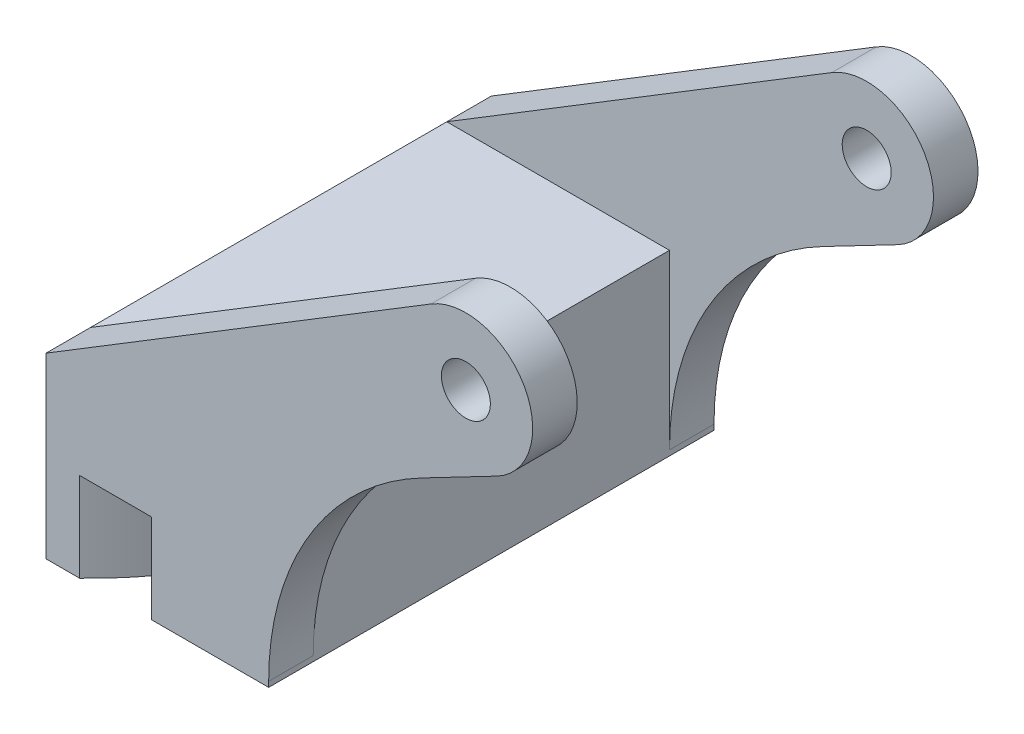
ISO-10303-21;
HEADER;
FILE_DESCRIPTION(('STEP AP214'),'2;1');
FILE_NAME('part.step','',(''),(''),'','','');
FILE_SCHEMA(('AUTOMOTIVE_DESIGN { 1 0 10303 214 1 1 1 1 }'));
ENDSEC;
DATA;
#1=APPLICATION_CONTEXT('core data for automotive mechanical design processes');
#2=APPLICATION_PROTOCOL_DEFINITION('international standard','automotive_design',2000,#1);
#3=PRODUCT_CONTEXT('',#1,'mechanical');
#4=PRODUCT('Part','Part','',(#3));
#5=PRODUCT_RELATED_PRODUCT_CATEGORY('part','',(#4));
#6=PRODUCT_DEFINITION_FORMATION('','',#4);
#7=PRODUCT_DEFINITION_CONTEXT('part definition',#1,'design');
#8=PRODUCT_DEFINITION('design','',#6,#7);
#9=PRODUCT_DEFINITION_SHAPE('','',#8);
#10=(LENGTH_UNIT() NAMED_UNIT(*) SI_UNIT(.MILLI.,.METRE.));
#11=(NAMED_UNIT(*) PLANE_ANGLE_UNIT() SI_UNIT($,.RADIAN.));
#12=(NAMED_UNIT(*) SI_UNIT($,.STERADIAN.) SOLID_ANGLE_UNIT());
#13=UNCERTAINTY_MEASURE_WITH_UNIT(LENGTH_MEASURE(1.E-05),#10,'distance_accuracy_value','');
#14=(GEOMETRIC_REPRESENTATION_CONTEXT(3) GLOBAL_UNCERTAINTY_ASSIGNED_CONTEXT((#13)) GLOBAL_UNIT_ASSIGNED_CONTEXT((#10,
#11,#12)) REPRESENTATION_CONTEXT('',''));
#15=CARTESIAN_POINT('',(0.,0.,0.));
#16=DIRECTION('',(0.,0.,1.));
#17=DIRECTION('',(1.,0.,0.));
#18=AXIS2_PLACEMENT_3D('',#15,#16,#17);
#19=CARTESIAN_POINT('',(-59.8690905122496,-38.0999999999997,63.5));
#20=DIRECTION('',(0.,1.,0.));
#21=DIRECTION('',(-1.,0.,0.));
#22=AXIS2_PLACEMENT_3D('',#19,#20,#21);
#23=PLANE('',#22);
#24=CARTESIAN_POINT('',(-85.2690905122496,-38.0999999999997,31.75));
#25=DIRECTION('',(0.,-1.,0.));
#26=DIRECTION('',(1.,0.,0.));
#27=AXIS2_PLACEMENT_3D('',#24,#25,#26);
#28=CIRCLE('',#27,43.815);
#29=CARTESIAN_POINT('',(-55.074857205209,-38.0999999999997,0.));
#30=VERTEX_POINT('',#29);
#31=CARTESIAN_POINT('',(-55.074857205209,-38.0999999999997,63.5));
#32=VERTEX_POINT('',#31);
#33=EDGE_CURVE('E172',#30,#32,#28,.T.);
#34=ORIENTED_EDGE('',*,*,#33,.F.);
#35=DIRECTION('',(1.,0.,0.));
#36=VECTOR('',#35,1.);
#37=CARTESIAN_POINT('',(-59.8690905122496,-38.0999999999997,0.));
#38=LINE('',#37,#36);
#39=CARTESIAN_POINT('',(-44.8030958377084,-38.0999999999997,0.));
#40=VERTEX_POINT('',#39);
#41=EDGE_CURVE('E208',#30,#40,#38,.T.);
#42=ORIENTED_EDGE('',*,*,#41,.T.);
#43=CARTESIAN_POINT('',(-85.2690905122496,-38.0999999999997,31.75));
#44=DIRECTION('',(0.,1.,0.));
#45=DIRECTION('',(1.,0.,0.));
#46=AXIS2_PLACEMENT_3D('',#43,#44,#45);
#47=CIRCLE('',#46,51.435);
#48=CARTESIAN_POINT('',(-44.8030958377084,-38.0999999999997,63.5));
#49=VERTEX_POINT('',#48);
#50=EDGE_CURVE('E175',#49,#40,#47,.T.);
#51=ORIENTED_EDGE('',*,*,#50,.F.);
#52=DIRECTION('',(1.,0.,0.));
#53=VECTOR('',#52,1.);
#54=CARTESIAN_POINT('',(-59.8690905122496,-38.0999999999997,63.5));
#55=LINE('',#54,#53);
#56=EDGE_CURVE('E213',#32,#49,#55,.T.);
#57=ORIENTED_EDGE('',*,*,#56,.F.);
#58=EDGE_LOOP('',(#34,#42,#51,#57));
#59=FACE_BOUND('',#58,.T.);
#60=ADVANCED_FACE('F33',(#59),#23,.F.);
#61=CARTESIAN_POINT('',(4.40302140132008,-8.44624339807451,63.5));
#62=DIRECTION('',(-0.462259464705518,0.886744713708612,0.));
#63=DIRECTION('',(-0.886744713708612,-0.462259464705518,0.));
#64=AXIS2_PLACEMENT_3D('',#61,#62,#63);
#65=PLANE('',#64);
#66=DIRECTION('',(0.886744713708612,0.462259464705518,0.));
#67=VECTOR('',#66,1.);
#68=CARTESIAN_POINT('',(4.40302140132008,-8.44624339807451,63.5));
#69=LINE('',#68,#67);
#70=CARTESIAN_POINT('',(-6.26531515788185,-14.0076405746417,63.5));
#71=VERTEX_POINT('',#70);
#72=CARTESIAN_POINT('',(4.40302140132009,-8.44624339807451,63.5));
#73=VERTEX_POINT('',#72);
#74=EDGE_CURVE('E291',#71,#73,#69,.T.);
#75=ORIENTED_EDGE('',*,*,#74,.F.);
#76=DIRECTION('',(0.,0.,-1.));
#77=VECTOR('',#76,1.);
#78=CARTESIAN_POINT('',(-6.26531515788185,-14.0076405746417,57.15));
#79=LINE('',#78,#77);
#80=CARTESIAN_POINT('',(-6.26531515788185,-14.0076405746417,57.15));
#81=VERTEX_POINT('',#80);
#82=EDGE_CURVE('E341',#71,#81,#79,.T.);
#83=ORIENTED_EDGE('',*,*,#82,.T.);
#84=DIRECTION('',(0.886744713708612,0.462259464705518,0.));
#85=VECTOR('',#84,1.);
#86=CARTESIAN_POINT('',(4.40302140132008,-8.44624339807451,57.15));
#87=LINE('',#86,#85);
#88=CARTESIAN_POINT('',(4.40302140132009,-8.44624339807451,57.15));
#89=VERTEX_POINT('',#88);
#90=EDGE_CURVE('E277',#81,#89,#87,.T.);
#91=ORIENTED_EDGE('',*,*,#90,.T.);
#92=DIRECTION('',(0.,0.,-1.));
#93=VECTOR('',#92,1.);
#94=CARTESIAN_POINT('',(4.40302140132009,-8.44624339807451,63.5));
#95=LINE('',#94,#93);
#96=EDGE_CURVE('E239',#73,#89,#95,.T.);
#97=ORIENTED_EDGE('',*,*,#96,.F.);
#98=EDGE_LOOP('',(#75,#83,#91,#97));
#99=FACE_BOUND('',#98,.T.);
#100=ADVANCED_FACE('F352',(#99),#65,.F.);
#101=CARTESIAN_POINT('',(0.,0.,63.5));
#102=DIRECTION('',(0.,0.,-1.));
#103=DIRECTION('',(-1.,0.,0.));
#104=AXIS2_PLACEMENT_3D('',#101,#102,#103);
#105=CYLINDRICAL_SURFACE('',#104,9.525);
#106=CARTESIAN_POINT('',(0.,0.,57.15));
#107=DIRECTION('',(0.,0.,1.));
#108=DIRECTION('',(1.,0.,0.));
#109=AXIS2_PLACEMENT_3D('',#106,#107,#108);
#110=CIRCLE('',#109,9.525);
#111=CARTESIAN_POINT('',(-4.96423642167006,8.12908246666033,57.15));
#112=VERTEX_POINT('',#111);
#113=EDGE_CURVE('E275',#89,#112,#110,.T.);
#114=ORIENTED_EDGE('',*,*,#113,.T.);
#115=DIRECTION('',(0.,0.,-1.));
#116=VECTOR('',#115,1.);
#117=CARTESIAN_POINT('',(-4.96423642167005,8.12908246666034,63.5));
#118=LINE('',#117,#116);
#119=CARTESIAN_POINT('',(-4.96423642167005,8.12908246666034,63.5));
#120=VERTEX_POINT('',#119);
#121=EDGE_CURVE('E235',#120,#112,#118,.T.);
#122=ORIENTED_EDGE('',*,*,#121,.F.);
#123=CARTESIAN_POINT('',(0.,0.,63.5));
#124=DIRECTION('',(0.,0.,1.));
#125=DIRECTION('',(1.,0.,0.));
#126=AXIS2_PLACEMENT_3D('',#123,#124,#125);
#127=CIRCLE('',#126,9.525);
#128=EDGE_CURVE('E293',#73,#120,#127,.T.);
#129=ORIENTED_EDGE('',*,*,#128,.F.);
#130=ORIENTED_EDGE('',*,*,#96,.T.);
#131=EDGE_LOOP('',(#114,#122,#129,#130));
#132=FACE_BOUND('',#131,.T.);
#133=ADVANCED_FACE('F356',(#132),#105,.T.);
#134=CARTESIAN_POINT('',(-59.8690905122496,-25.3999999999997,63.5));
#135=DIRECTION('',(0.521179676815753,-0.85344697812707,0.));
#136=DIRECTION('',(0.85344697812707,0.521179676815753,0.));
#137=AXIS2_PLACEMENT_3D('',#134,#135,#136);
#138=PLANE('',#137);
#139=ORIENTED_EDGE('',*,*,#121,.T.);
#140=DIRECTION('',(-0.85344697812707,-0.521179676815753,0.));
#141=VECTOR('',#140,1.);
#142=CARTESIAN_POINT('',(-59.8690905122496,-25.3999999999997,57.15));
#143=LINE('',#142,#141);
#144=CARTESIAN_POINT('',(-59.8690905122496,-25.3999999999997,57.15));
#145=VERTEX_POINT('',#144);
#146=EDGE_CURVE('E250',#112,#145,#143,.T.);
#147=ORIENTED_EDGE('',*,*,#146,.T.);
#148=DIRECTION('',(0.,0.,-1.));
#149=VECTOR('',#148,1.);
#150=CARTESIAN_POINT('',(-59.8690905122496,-25.3999999999997,63.5));
#151=LINE('',#150,#149);
#152=CARTESIAN_POINT('',(-59.8690905122496,-25.3999999999997,63.5));
#153=VERTEX_POINT('',#152);
#154=EDGE_CURVE('E230',#153,#145,#151,.T.);
#155=ORIENTED_EDGE('',*,*,#154,.F.);
#156=DIRECTION('',(-0.85344697812707,-0.521179676815753,0.));
#157=VECTOR('',#156,1.);
#158=CARTESIAN_POINT('',(-59.8690905122496,-25.3999999999997,63.5));
#159=LINE('',#158,#157);
#160=EDGE_CURVE('E294',#120,#153,#159,.T.);
#161=ORIENTED_EDGE('',*,*,#160,.F.);
#162=EDGE_LOOP('',(#139,#147,#155,#161));
#163=FACE_BOUND('',#162,.T.);
#164=ADVANCED_FACE('F310',(#163),#138,.F.);
#165=CARTESIAN_POINT('',(0.,0.,63.5));
#166=DIRECTION('',(0.,0.,-1.));
#167=DIRECTION('',(-1.,0.,0.));
#168=AXIS2_PLACEMENT_3D('',#165,#166,#167);
#169=CYLINDRICAL_SURFACE('',#168,3.4925);
#170=CARTESIAN_POINT('',(0.,0.,57.15));
#171=DIRECTION('',(0.,0.,1.));
#172=DIRECTION('',(1.,0.,0.));
#173=AXIS2_PLACEMENT_3D('',#170,#171,#172);
#174=CIRCLE('',#173,3.4925);
#175=CARTESIAN_POINT('',(3.4925,0.,57.15));
#176=VERTEX_POINT('',#175);
#177=EDGE_CURVE('E248',#176,#176,#174,.T.);
#178=ORIENTED_EDGE('',*,*,#177,.F.);
#179=EDGE_LOOP('',(#178));
#180=FACE_BOUND('',#179,.T.);
#181=CARTESIAN_POINT('',(0.,0.,63.5));
#182=DIRECTION('',(0.,0.,1.));
#183=DIRECTION('',(1.,0.,0.));
#184=AXIS2_PLACEMENT_3D('',#181,#182,#183);
#185=CIRCLE('',#184,3.4925);
#186=CARTESIAN_POINT('',(3.4925,0.,63.5));
#187=VERTEX_POINT('',#186);
#188=EDGE_CURVE('E282',#187,#187,#185,.T.);
#189=ORIENTED_EDGE('',*,*,#188,.T.);
#190=EDGE_LOOP('',(#189));
#191=FACE_BOUND('',#190,.T.);
#192=ADVANCED_FACE('F363',(#180,#191),#169,.F.);
#193=CARTESIAN_POINT('',(0.,0.,63.5));
#194=DIRECTION('',(0.,0.,1.));
#195=DIRECTION('',(1.,0.,0.));
#196=AXIS2_PLACEMENT_3D('',#193,#194,#195);
#197=PLANE('',#196);
#198=DIRECTION('',(0.,-1.,0.));
#199=VECTOR('',#198,1.);
#200=CARTESIAN_POINT('',(-59.8690905122496,-25.3999999999997,63.5));
#201=LINE('',#200,#199);
#202=CARTESIAN_POINT('',(-59.8690905122496,-50.7999999999997,63.5));
#203=VERTEX_POINT('',#202);
#204=EDGE_CURVE('E158',#153,#203,#201,.T.);
#205=ORIENTED_EDGE('',*,*,#204,.T.);
#206=DIRECTION('',(-1.,0.,0.));
#207=VECTOR('',#206,1.);
#208=CARTESIAN_POINT('',(-55.074857205209,-50.7999999999997,63.5));
#209=LINE('',#208,#207);
#210=CARTESIAN_POINT('',(-55.074857205209,-50.7999999999997,63.5));
#211=VERTEX_POINT('',#210);
#212=EDGE_CURVE('E150',#211,#203,#209,.T.);
#213=ORIENTED_EDGE('',*,*,#212,.F.);
#214=DIRECTION('',(0.,1.,0.));
#215=VECTOR('',#214,1.);
#216=CARTESIAN_POINT('',(-55.074857205209,-50.7999999999997,63.5));
#217=LINE('',#216,#215);
#218=EDGE_CURVE('E155',#211,#32,#217,.T.);
#219=ORIENTED_EDGE('',*,*,#218,.T.);
#220=ORIENTED_EDGE('',*,*,#56,.T.);
#221=DIRECTION('',(0.,1.,0.));
#222=VECTOR('',#221,1.);
#223=CARTESIAN_POINT('',(-44.8030958377084,-50.7999999999997,63.5));
#224=LINE('',#223,#222);
#225=CARTESIAN_POINT('',(-44.8030958377084,-50.7999999999997,63.5));
#226=VERTEX_POINT('',#225);
#227=EDGE_CURVE('E194',#226,#49,#224,.T.);
#228=ORIENTED_EDGE('',*,*,#227,.F.);
#229=DIRECTION('',(-1.,0.,0.));
#230=VECTOR('',#229,1.);
#231=CARTESIAN_POINT('',(-44.8030958377084,-50.7999999999997,63.5));
#232=LINE('',#231,#230);
#233=CARTESIAN_POINT('',(-28.1190905122496,-50.7999999999997,63.5));
#234=VERTEX_POINT('',#233);
#235=EDGE_CURVE('E192',#234,#226,#232,.T.);
#236=ORIENTED_EDGE('',*,*,#235,.F.);
#237=DIRECTION('',(0.,1.,0.));
#238=VECTOR('',#237,1.);
#239=CARTESIAN_POINT('',(-28.1190905122496,-38.0999999999997,63.5));
#240=LINE('',#239,#238);
#241=CARTESIAN_POINT('',(-28.1190905122496,-50.0449457397598,63.5));
#242=VERTEX_POINT('',#241);
#243=EDGE_CURVE('E289',#234,#242,#240,.T.);
#244=ORIENTED_EDGE('',*,*,#243,.T.);
#245=CARTESIAN_POINT('',(12.5209094877504,-50.0449457397597,63.5));
#246=DIRECTION('',(0.,0.,1.));
#247=DIRECTION('',(1.,0.,0.));
#248=AXIS2_PLACEMENT_3D('',#245,#246,#247);
#249=CIRCLE('',#248,40.64);
#250=EDGE_CURVE('E11',#242,#71,#249,.F.);
#251=ORIENTED_EDGE('',*,*,#250,.T.);
#252=ORIENTED_EDGE('',*,*,#74,.T.);
#253=ORIENTED_EDGE('',*,*,#128,.T.);
#254=ORIENTED_EDGE('',*,*,#160,.T.);
#255=EDGE_LOOP('',(#205,#213,#219,#220,#228,#236,#244,#251,#252,#253,#254));
#256=FACE_BOUND('',#255,.T.);
#257=ORIENTED_EDGE('',*,*,#188,.F.);
#258=EDGE_LOOP('',(#257));
#259=FACE_BOUND('',#258,.T.);
#260=ADVANCED_FACE('F152',(#256,#259),#197,.T.);
#261=CARTESIAN_POINT('',(0.,0.,0.));
#262=DIRECTION('',(0.,0.,1.));
#263=DIRECTION('',(1.,0.,0.));
#264=AXIS2_PLACEMENT_3D('',#261,#262,#263);
#265=PLANE('',#264);
#266=DIRECTION('',(0.,-1.,0.));
#267=VECTOR('',#266,1.);
#268=CARTESIAN_POINT('',(-59.8690905122496,-25.3999999999997,0.));
#269=LINE('',#268,#267);
#270=CARTESIAN_POINT('',(-59.8690905122496,-25.3999999999997,0.));
#271=VERTEX_POINT('',#270);
#272=CARTESIAN_POINT('',(-59.8690905122496,-50.7999999999997,0.));
#273=VERTEX_POINT('',#272);
#274=EDGE_CURVE('E212',#271,#273,#269,.T.);
#275=ORIENTED_EDGE('',*,*,#274,.F.);
#276=DIRECTION('',(-0.85344697812707,-0.521179676815753,0.));
#277=VECTOR('',#276,1.);
#278=CARTESIAN_POINT('',(-59.8690905122496,-25.3999999999997,0.));
#279=LINE('',#278,#277);
#280=CARTESIAN_POINT('',(-4.96423642167005,8.12908246666034,0.));
#281=VERTEX_POINT('',#280);
#282=EDGE_CURVE('E227',#281,#271,#279,.T.);
#283=ORIENTED_EDGE('',*,*,#282,.F.);
#284=CARTESIAN_POINT('',(0.,0.,0.));
#285=DIRECTION('',(0.,0.,1.));
#286=DIRECTION('',(1.,0.,0.));
#287=AXIS2_PLACEMENT_3D('',#284,#285,#286);
#288=CIRCLE('',#287,9.525);
#289=CARTESIAN_POINT('',(4.40302140132009,-8.44624339807451,0.));
#290=VERTEX_POINT('',#289);
#291=EDGE_CURVE('E224',#290,#281,#288,.T.);
#292=ORIENTED_EDGE('',*,*,#291,.F.);
#293=DIRECTION('',(0.886744713708612,0.462259464705518,0.));
#294=VECTOR('',#293,1.);
#295=CARTESIAN_POINT('',(4.40302140132008,-8.44624339807451,0.));
#296=LINE('',#295,#294);
#297=CARTESIAN_POINT('',(-6.26531515788185,-14.0076405746417,0.));
#298=VERTEX_POINT('',#297);
#299=EDGE_CURVE('E222',#298,#290,#296,.T.);
#300=ORIENTED_EDGE('',*,*,#299,.F.);
#301=CARTESIAN_POINT('',(12.5209094877504,-50.0449457397597,0.));
#302=DIRECTION('',(0.,0.,1.));
#303=DIRECTION('',(1.,0.,0.));
#304=AXIS2_PLACEMENT_3D('',#301,#302,#303);
#305=CIRCLE('',#304,40.64);
#306=CARTESIAN_POINT('',(-28.1190905122496,-50.0449457397598,0.));
#307=VERTEX_POINT('',#306);
#308=EDGE_CURVE('E325',#298,#307,#305,.T.);
#309=ORIENTED_EDGE('',*,*,#308,.T.);
#310=DIRECTION('',(0.,1.,0.));
#311=VECTOR('',#310,1.);
#312=CARTESIAN_POINT('',(-28.1190905122496,-38.0999999999997,0.));
#313=LINE('',#312,#311);
#314=CARTESIAN_POINT('',(-28.1190905122496,-50.7999999999997,0.));
#315=VERTEX_POINT('',#314);
#316=EDGE_CURVE('E211',#315,#307,#313,.T.);
#317=ORIENTED_EDGE('',*,*,#316,.F.);
#318=DIRECTION('',(1.,0.,0.));
#319=VECTOR('',#318,1.);
#320=CARTESIAN_POINT('',(-28.1190905122496,-50.7999999999997,0.));
#321=LINE('',#320,#319);
#322=CARTESIAN_POINT('',(-44.8030958377084,-50.7999999999997,0.));
#323=VERTEX_POINT('',#322);
#324=EDGE_CURVE('E186',#323,#315,#321,.T.);
#325=ORIENTED_EDGE('',*,*,#324,.F.);
#326=DIRECTION('',(0.,1.,0.));
#327=VECTOR('',#326,1.);
#328=CARTESIAN_POINT('',(-44.8030958377084,-50.7999999999997,0.));
#329=LINE('',#328,#327);
#330=EDGE_CURVE('E205',#323,#40,#329,.T.);
#331=ORIENTED_EDGE('',*,*,#330,.T.);
#332=ORIENTED_EDGE('',*,*,#41,.F.);
#333=DIRECTION('',(0.,1.,0.));
#334=VECTOR('',#333,1.);
#335=CARTESIAN_POINT('',(-55.074857205209,-50.7999999999997,0.));
#336=LINE('',#335,#334);
#337=CARTESIAN_POINT('',(-55.074857205209,-50.7999999999997,0.));
#338=VERTEX_POINT('',#337);
#339=EDGE_CURVE('E176',#338,#30,#336,.T.);
#340=ORIENTED_EDGE('',*,*,#339,.F.);
#341=DIRECTION('',(1.,0.,0.));
#342=VECTOR('',#341,1.);
#343=CARTESIAN_POINT('',(-59.8690905122496,-50.7999999999997,0.));
#344=LINE('',#343,#342);
#345=EDGE_CURVE('E168',#273,#338,#344,.T.);
#346=ORIENTED_EDGE('',*,*,#345,.F.);
#347=EDGE_LOOP('',(#275,#283,#292,#300,#309,#317,#325,#331,#332,#340,#346));
#348=FACE_BOUND('',#347,.T.);
#349=CARTESIAN_POINT('',(0.,0.,0.));
#350=DIRECTION('',(0.,0.,1.));
#351=DIRECTION('',(1.,0.,0.));
#352=AXIS2_PLACEMENT_3D('',#349,#350,#351);
#353=CIRCLE('',#352,3.4925);
#354=CARTESIAN_POINT('',(3.4925,0.,0.));
#355=VERTEX_POINT('',#354);
#356=EDGE_CURVE('E281',#355,#355,#353,.T.);
#357=ORIENTED_EDGE('',*,*,#356,.T.);
#358=EDGE_LOOP('',(#357));
#359=FACE_BOUND('',#358,.T.);
#360=ADVANCED_FACE('F305',(#348,#359),#265,.F.);
#361=CARTESIAN_POINT('',(-59.8690905122496,-25.3999999999997,63.5));
#362=DIRECTION('',(1.,0.,0.));
#363=DIRECTION('',(0.,0.,-1.));
#364=AXIS2_PLACEMENT_3D('',#361,#362,#363);
#365=PLANE('',#364);
#366=ORIENTED_EDGE('',*,*,#274,.T.);
#367=DIRECTION('',(0.,0.,-1.));
#368=VECTOR('',#367,1.);
#369=CARTESIAN_POINT('',(-59.8690905122496,-50.7999999999997,63.5));
#370=LINE('',#369,#368);
#371=EDGE_CURVE('E162',#203,#273,#370,.T.);
#372=ORIENTED_EDGE('',*,*,#371,.F.);
#373=ORIENTED_EDGE('',*,*,#204,.F.);
#374=ORIENTED_EDGE('',*,*,#154,.T.);
#375=DIRECTION('',(0.,0.,-1.));
#376=VECTOR('',#375,1.);
#377=CARTESIAN_POINT('',(-59.8690905122496,-25.3999999999997,57.15));
#378=LINE('',#377,#376);
#379=CARTESIAN_POINT('',(-59.8690905122496,-25.3999999999997,6.35));
#380=VERTEX_POINT('',#379);
#381=EDGE_CURVE('E197',#145,#380,#378,.T.);
#382=ORIENTED_EDGE('',*,*,#381,.T.);
#383=EDGE_CURVE('E234',#380,#271,#151,.T.);
#384=ORIENTED_EDGE('',*,*,#383,.T.);
#385=EDGE_LOOP('',(#366,#372,#373,#374,#382,#384));
#386=FACE_BOUND('',#385,.T.);
#387=ADVANCED_FACE('F298',(#386),#365,.F.);
#388=CARTESIAN_POINT('',(-28.1190905122496,-38.0999999999997,63.5));
#389=DIRECTION('',(-1.,0.,0.));
#390=DIRECTION('',(0.,-1.,0.));
#391=AXIS2_PLACEMENT_3D('',#388,#389,#390);
#392=PLANE('',#391);
#393=ORIENTED_EDGE('',*,*,#316,.T.);
#394=DIRECTION('',(0.,0.,-1.));
#395=VECTOR('',#394,1.);
#396=CARTESIAN_POINT('',(-28.1190905122496,-50.0449457397598,6.35));
#397=LINE('',#396,#395);
#398=CARTESIAN_POINT('',(-28.1190905122496,-50.0449457397598,6.35));
#399=VERTEX_POINT('',#398);
#400=EDGE_CURVE('E338',#307,#399,#397,.F.);
#401=ORIENTED_EDGE('',*,*,#400,.T.);
#402=DIRECTION('',(0.,1.,0.));
#403=VECTOR('',#402,1.);
#404=CARTESIAN_POINT('',(-28.1190905122496,-25.3999999999997,6.35));
#405=LINE('',#404,#403);
#406=CARTESIAN_POINT('',(-28.1190905122496,-25.3999999999997,6.35));
#407=VERTEX_POINT('',#406);
#408=EDGE_CURVE('E336',#399,#407,#405,.T.);
#409=ORIENTED_EDGE('',*,*,#408,.T.);
#410=DIRECTION('',(0.,0.,1.));
#411=VECTOR('',#410,1.);
#412=CARTESIAN_POINT('',(-28.1190905122496,-25.3999999999997,63.5));
#413=LINE('',#412,#411);
#414=CARTESIAN_POINT('',(-28.1190905122496,-25.3999999999997,57.15));
#415=VERTEX_POINT('',#414);
#416=EDGE_CURVE('E279',#407,#415,#413,.T.);
#417=ORIENTED_EDGE('',*,*,#416,.T.);
#418=DIRECTION('',(0.,-1.,0.));
#419=VECTOR('',#418,1.);
#420=CARTESIAN_POINT('',(-28.1190905122496,-25.3999999999997,57.15));
#421=LINE('',#420,#419);
#422=CARTESIAN_POINT('',(-28.1190905122496,-50.0449457397598,57.15));
#423=VERTEX_POINT('',#422);
#424=EDGE_CURVE('E48',#415,#423,#421,.T.);
#425=ORIENTED_EDGE('',*,*,#424,.T.);
#426=DIRECTION('',(0.,0.,-1.));
#427=VECTOR('',#426,1.);
#428=CARTESIAN_POINT('',(-28.1190905122496,-50.0449457397598,63.5));
#429=LINE('',#428,#427);
#430=EDGE_CURVE('E332',#423,#242,#429,.F.);
#431=ORIENTED_EDGE('',*,*,#430,.T.);
#432=ORIENTED_EDGE('',*,*,#243,.F.);
#433=DIRECTION('',(0.,0.,1.));
#434=VECTOR('',#433,1.);
#435=CARTESIAN_POINT('',(-28.1190905122496,-50.7999999999997,63.5));
#436=LINE('',#435,#434);
#437=EDGE_CURVE('E189',#315,#234,#436,.T.);
#438=ORIENTED_EDGE('',*,*,#437,.F.);
#439=EDGE_LOOP('',(#393,#401,#409,#417,#425,#431,#432,#438));
#440=FACE_BOUND('',#439,.T.);
#441=ADVANCED_FACE('F350',(#440),#392,.F.);
#442=DIRECTION('',(-0.886744713708612,-0.462259464705518,0.));
#443=VECTOR('',#442,1.);
#444=CARTESIAN_POINT('',(4.40302140132008,-8.44624339807451,6.35));
#445=LINE('',#444,#443);
#446=CARTESIAN_POINT('',(4.40302140132009,-8.44624339807451,6.35));
#447=VERTEX_POINT('',#446);
#448=CARTESIAN_POINT('',(-6.26531515788185,-14.0076405746417,6.35));
#449=VERTEX_POINT('',#448);
#450=EDGE_CURVE('E251',#447,#449,#445,.T.);
#451=ORIENTED_EDGE('',*,*,#450,.T.);
#452=DIRECTION('',(0.,0.,-1.));
#453=VECTOR('',#452,1.);
#454=CARTESIAN_POINT('',(-6.26531515788185,-14.0076405746417,0.));
#455=LINE('',#454,#453);
#456=EDGE_CURVE('E242',#449,#298,#455,.T.);
#457=ORIENTED_EDGE('',*,*,#456,.T.);
#458=ORIENTED_EDGE('',*,*,#299,.T.);
#459=EDGE_CURVE('E238',#447,#290,#95,.T.);
#460=ORIENTED_EDGE('',*,*,#459,.F.);
#461=EDGE_LOOP('',(#451,#457,#458,#460));
#462=FACE_BOUND('',#461,.T.);
#463=ADVANCED_FACE('F328',(#462),#65,.F.);
#464=CARTESIAN_POINT('',(-4.96423642167006,8.12908246666033,6.35));
#465=VERTEX_POINT('',#464);
#466=EDGE_CURVE('E233',#465,#281,#118,.T.);
#467=ORIENTED_EDGE('',*,*,#466,.F.);
#468=CARTESIAN_POINT('',(0.,0.,6.35));
#469=DIRECTION('',(0.,0.,-1.));
#470=DIRECTION('',(-1.,0.,0.));
#471=AXIS2_PLACEMENT_3D('',#468,#469,#470);
#472=CIRCLE('',#471,9.525);
#473=EDGE_CURVE('E268',#465,#447,#472,.T.);
#474=ORIENTED_EDGE('',*,*,#473,.T.);
#475=ORIENTED_EDGE('',*,*,#459,.T.);
#476=ORIENTED_EDGE('',*,*,#291,.T.);
#477=EDGE_LOOP('',(#467,#474,#475,#476));
#478=FACE_BOUND('',#477,.T.);
#479=ADVANCED_FACE('F321',(#478),#105,.T.);
#480=ORIENTED_EDGE('',*,*,#383,.F.);
#481=DIRECTION('',(0.85344697812707,0.521179676815753,0.));
#482=VECTOR('',#481,1.);
#483=CARTESIAN_POINT('',(-59.8690905122496,-25.3999999999997,6.35));
#484=LINE('',#483,#482);
#485=EDGE_CURVE('E246',#380,#465,#484,.T.);
#486=ORIENTED_EDGE('',*,*,#485,.T.);
#487=ORIENTED_EDGE('',*,*,#466,.T.);
#488=ORIENTED_EDGE('',*,*,#282,.T.);
#489=EDGE_LOOP('',(#480,#486,#487,#488));
#490=FACE_BOUND('',#489,.T.);
#491=ADVANCED_FACE('F302',(#490),#138,.F.);
#492=CARTESIAN_POINT('',(0.,0.,6.35));
#493=DIRECTION('',(0.,0.,-1.));
#494=DIRECTION('',(-1.,0.,0.));
#495=AXIS2_PLACEMENT_3D('',#492,#493,#494);
#496=CIRCLE('',#495,3.4925);
#497=CARTESIAN_POINT('',(-3.4925,0.,6.35));
#498=VERTEX_POINT('',#497);
#499=EDGE_CURVE('E243',#498,#498,#496,.T.);
#500=ORIENTED_EDGE('',*,*,#499,.F.);
#501=EDGE_LOOP('',(#500));
#502=FACE_BOUND('',#501,.T.);
#503=ORIENTED_EDGE('',*,*,#356,.F.);
#504=EDGE_LOOP('',(#503));
#505=FACE_BOUND('',#504,.T.);
#506=ADVANCED_FACE('F405',(#502,#505),#169,.F.);
#507=CARTESIAN_POINT('',(-59.8690905122496,-25.3999999999997,57.15));
#508=DIRECTION('',(0.,-1.,0.));
#509=DIRECTION('',(0.,0.,-1.));
#510=AXIS2_PLACEMENT_3D('',#507,#508,#509);
#511=PLANE('',#510);
#512=DIRECTION('',(1.,0.,0.));
#513=VECTOR('',#512,1.);
#514=CARTESIAN_POINT('',(-59.8690905122496,-25.3999999999997,6.35));
#515=LINE('',#514,#513);
#516=EDGE_CURVE('E247',#380,#407,#515,.T.);
#517=ORIENTED_EDGE('',*,*,#516,.F.);
#518=ORIENTED_EDGE('',*,*,#381,.F.);
#519=DIRECTION('',(1.,0.,0.));
#520=VECTOR('',#519,1.);
#521=CARTESIAN_POINT('',(-59.8690905122496,-25.3999999999997,57.15));
#522=LINE('',#521,#520);
#523=EDGE_CURVE('E257',#145,#415,#522,.T.);
#524=ORIENTED_EDGE('',*,*,#523,.T.);
#525=ORIENTED_EDGE('',*,*,#416,.F.);
#526=EDGE_LOOP('',(#517,#518,#524,#525));
#527=FACE_BOUND('',#526,.T.);
#528=ADVANCED_FACE('F316',(#527),#511,.F.);
#529=CARTESIAN_POINT('',(-59.8690905122496,-25.3999999999997,57.15));
#530=DIRECTION('',(0.,0.,1.));
#531=DIRECTION('',(1.,0.,0.));
#532=AXIS2_PLACEMENT_3D('',#529,#530,#531);
#533=PLANE('',#532);
#534=ORIENTED_EDGE('',*,*,#177,.T.);
#535=EDGE_LOOP('',(#534));
#536=FACE_BOUND('',#535,.T.);
#537=ORIENTED_EDGE('',*,*,#523,.F.);
#538=ORIENTED_EDGE('',*,*,#146,.F.);
#539=ORIENTED_EDGE('',*,*,#113,.F.);
#540=ORIENTED_EDGE('',*,*,#90,.F.);
#541=CARTESIAN_POINT('',(12.5209094877504,-50.0449457397597,57.15));
#542=DIRECTION('',(0.,0.,1.));
#543=DIRECTION('',(1.,0.,0.));
#544=AXIS2_PLACEMENT_3D('',#541,#542,#543);
#545=CIRCLE('',#544,40.64);
#546=EDGE_CURVE('E41',#81,#423,#545,.T.);
#547=ORIENTED_EDGE('',*,*,#546,.T.);
#548=ORIENTED_EDGE('',*,*,#424,.F.);
#549=EDGE_LOOP('',(#537,#538,#539,#540,#547,#548));
#550=FACE_BOUND('',#549,.T.);
#551=ADVANCED_FACE('F314',(#536,#550),#533,.F.);
#552=CARTESIAN_POINT('',(-59.8690905122496,-25.3999999999997,6.35));
#553=DIRECTION('',(0.,0.,-1.));
#554=DIRECTION('',(-1.,0.,0.));
#555=AXIS2_PLACEMENT_3D('',#552,#553,#554);
#556=PLANE('',#555);
#557=ORIENTED_EDGE('',*,*,#499,.T.);
#558=EDGE_LOOP('',(#557));
#559=FACE_BOUND('',#558,.T.);
#560=ORIENTED_EDGE('',*,*,#473,.F.);
#561=ORIENTED_EDGE('',*,*,#485,.F.);
#562=ORIENTED_EDGE('',*,*,#516,.T.);
#563=ORIENTED_EDGE('',*,*,#408,.F.);
#564=CARTESIAN_POINT('',(12.5209094877504,-50.0449457397597,6.35));
#565=DIRECTION('',(0.,0.,-1.));
#566=DIRECTION('',(-1.,0.,0.));
#567=AXIS2_PLACEMENT_3D('',#564,#565,#566);
#568=CIRCLE('',#567,40.64);
#569=EDGE_CURVE('E345',#399,#449,#568,.T.);
#570=ORIENTED_EDGE('',*,*,#569,.T.);
#571=ORIENTED_EDGE('',*,*,#450,.F.);
#572=EDGE_LOOP('',(#560,#561,#562,#563,#570,#571));
#573=FACE_BOUND('',#572,.T.);
#574=ADVANCED_FACE('F319',(#559,#573),#556,.F.);
#575=CARTESIAN_POINT('',(-85.2690905122496,-50.7999999999997,31.75));
#576=DIRECTION('',(0.,1.,0.));
#577=DIRECTION('',(-1.,0.,0.));
#578=AXIS2_PLACEMENT_3D('',#575,#576,#577);
#579=CYLINDRICAL_SURFACE('',#578,51.435);
#580=ORIENTED_EDGE('',*,*,#50,.T.);
#581=ORIENTED_EDGE('',*,*,#330,.F.);
#582=CARTESIAN_POINT('',(-85.2690905122496,-50.7999999999997,31.75));
#583=DIRECTION('',(0.,1.,0.));
#584=DIRECTION('',(1.,0.,0.));
#585=AXIS2_PLACEMENT_3D('',#582,#583,#584);
#586=CIRCLE('',#585,51.435);
#587=EDGE_CURVE('E179',#226,#323,#586,.T.);
#588=ORIENTED_EDGE('',*,*,#587,.F.);
#589=ORIENTED_EDGE('',*,*,#227,.T.);
#590=EDGE_LOOP('',(#580,#581,#588,#589));
#591=FACE_BOUND('',#590,.T.);
#592=ADVANCED_FACE('F390',(#591),#579,.F.);
#593=CARTESIAN_POINT('',(-85.2690905122496,-50.7999999999997,31.75));
#594=DIRECTION('',(0.,-1.,0.));
#595=DIRECTION('',(1.,0.,0.));
#596=AXIS2_PLACEMENT_3D('',#593,#594,#595);
#597=PLANE('',#596);
#598=ORIENTED_EDGE('',*,*,#587,.T.);
#599=ORIENTED_EDGE('',*,*,#324,.T.);
#600=ORIENTED_EDGE('',*,*,#437,.T.);
#601=ORIENTED_EDGE('',*,*,#235,.T.);
#602=EDGE_LOOP('',(#598,#599,#600,#601));
#603=FACE_BOUND('',#602,.T.);
#604=ADVANCED_FACE('F385',(#603),#597,.T.);
#605=CARTESIAN_POINT('',(-85.2690905122496,-50.7999999999997,31.75));
#606=DIRECTION('',(0.,1.,0.));
#607=DIRECTION('',(-1.,0.,0.));
#608=AXIS2_PLACEMENT_3D('',#605,#606,#607);
#609=CYLINDRICAL_SURFACE('',#608,43.815);
#610=ORIENTED_EDGE('',*,*,#33,.T.);
#611=ORIENTED_EDGE('',*,*,#218,.F.);
#612=CARTESIAN_POINT('',(-85.2690905122496,-50.7999999999997,31.75));
#613=DIRECTION('',(0.,-1.,0.));
#614=DIRECTION('',(1.,0.,0.));
#615=AXIS2_PLACEMENT_3D('',#612,#613,#614);
#616=CIRCLE('',#615,43.815);
#617=EDGE_CURVE('E163',#338,#211,#616,.T.);
#618=ORIENTED_EDGE('',*,*,#617,.F.);
#619=ORIENTED_EDGE('',*,*,#339,.T.);
#620=EDGE_LOOP('',(#610,#611,#618,#619));
#621=FACE_BOUND('',#620,.T.);
#622=ADVANCED_FACE('F174',(#621),#609,.T.);
#623=CARTESIAN_POINT('',(-85.2690905122496,-50.7999999999997,31.75));
#624=DIRECTION('',(0.,-1.,0.));
#625=DIRECTION('',(1.,0.,0.));
#626=AXIS2_PLACEMENT_3D('',#623,#624,#625);
#627=PLANE('',#626);
#628=ORIENTED_EDGE('',*,*,#617,.T.);
#629=ORIENTED_EDGE('',*,*,#212,.T.);
#630=ORIENTED_EDGE('',*,*,#371,.T.);
#631=ORIENTED_EDGE('',*,*,#345,.T.);
#632=EDGE_LOOP('',(#628,#629,#630,#631));
#633=FACE_BOUND('',#632,.T.);
#634=ADVANCED_FACE('F166',(#633),#627,.T.);
#635=CARTESIAN_POINT('',(12.5209094877504,-50.0449457397597,63.5));
#636=DIRECTION('',(0.,0.,1.));
#637=DIRECTION('',(1.,0.,0.));
#638=AXIS2_PLACEMENT_3D('',#635,#636,#637);
#639=CYLINDRICAL_SURFACE('',#638,40.64);
#640=ORIENTED_EDGE('',*,*,#569,.F.);
#641=ORIENTED_EDGE('',*,*,#400,.F.);
#642=ORIENTED_EDGE('',*,*,#308,.F.);
#643=ORIENTED_EDGE('',*,*,#456,.F.);
#644=EDGE_LOOP('',(#640,#641,#642,#643));
#645=FACE_BOUND('',#644,.T.);
#646=ADVANCED_FACE('F375',(#645),#639,.F.);
#647=CARTESIAN_POINT('',(12.5209094877504,-50.0449457397597,63.5));
#648=DIRECTION('',(0.,0.,1.));
#649=DIRECTION('',(1.,0.,0.));
#650=AXIS2_PLACEMENT_3D('',#647,#648,#649);
#651=CYLINDRICAL_SURFACE('',#650,40.64);
#652=ORIENTED_EDGE('',*,*,#250,.F.);
#653=ORIENTED_EDGE('',*,*,#430,.F.);
#654=ORIENTED_EDGE('',*,*,#546,.F.);
#655=ORIENTED_EDGE('',*,*,#82,.F.);
#656=EDGE_LOOP('',(#652,#653,#654,#655));
#657=FACE_BOUND('',#656,.T.);
#658=ADVANCED_FACE('F35',(#657),#651,.F.);
#659=CLOSED_SHELL('',(#60,#100,#133,#164,#192,#260,#360,#387,#441,#463,#479,#491,#506,#528,#551,
#574,#592,#604,#622,#634,#646,#658));
#660=MANIFOLD_SOLID_BREP('B2',#659);
#661=ADVANCED_BREP_SHAPE_REPRESENTATION('',(#18,#660),#14);
#662=SHAPE_DEFINITION_REPRESENTATION(#9,#661);
ENDSEC;
END-ISO-10303-21;
